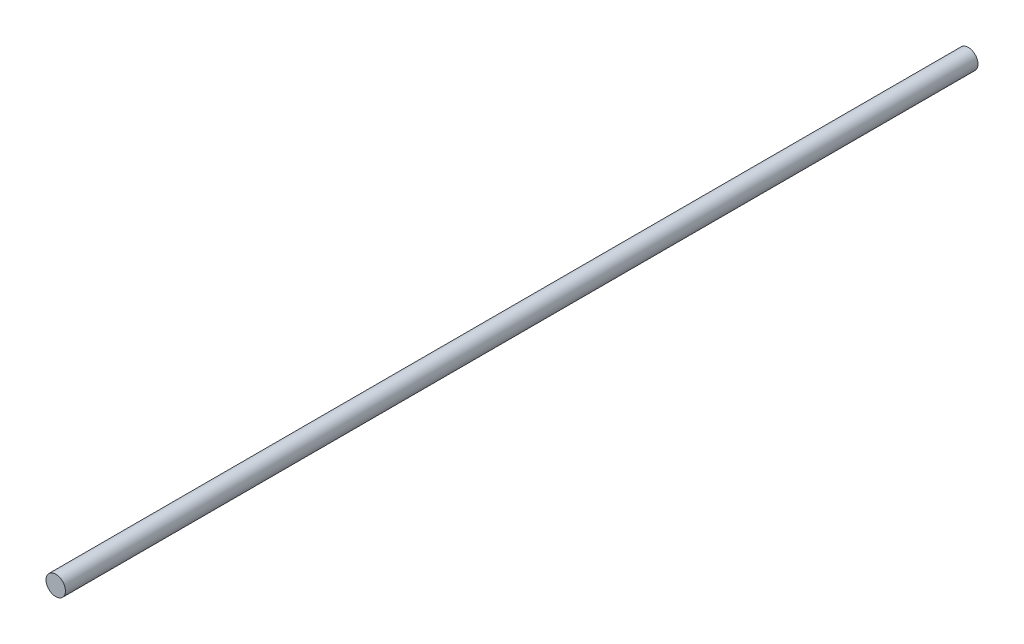
ISO-10303-21;
HEADER;
FILE_DESCRIPTION(('STEP AP214'),'2;1');
FILE_NAME('part.step','',(''),(''),'','','');
FILE_SCHEMA(('AUTOMOTIVE_DESIGN { 1 0 10303 214 1 1 1 1 }'));
ENDSEC;
DATA;
#1=APPLICATION_CONTEXT('core data for automotive mechanical design processes');
#2=APPLICATION_PROTOCOL_DEFINITION('international standard','automotive_design',2000,#1);
#3=PRODUCT_CONTEXT('',#1,'mechanical');
#4=PRODUCT('Part','Part','',(#3));
#5=PRODUCT_RELATED_PRODUCT_CATEGORY('part','',(#4));
#6=PRODUCT_DEFINITION_FORMATION('','',#4);
#7=PRODUCT_DEFINITION_CONTEXT('part definition',#1,'design');
#8=PRODUCT_DEFINITION('design','',#6,#7);
#9=PRODUCT_DEFINITION_SHAPE('','',#8);
#10=(LENGTH_UNIT() NAMED_UNIT(*) SI_UNIT(.MILLI.,.METRE.));
#11=(NAMED_UNIT(*) PLANE_ANGLE_UNIT() SI_UNIT($,.RADIAN.));
#12=(NAMED_UNIT(*) SI_UNIT($,.STERADIAN.) SOLID_ANGLE_UNIT());
#13=UNCERTAINTY_MEASURE_WITH_UNIT(LENGTH_MEASURE(1.E-05),#10,'distance_accuracy_value','');
#14=(GEOMETRIC_REPRESENTATION_CONTEXT(3) GLOBAL_UNCERTAINTY_ASSIGNED_CONTEXT((#13)) GLOBAL_UNIT_ASSIGNED_CONTEXT((#10,
#11,#12)) REPRESENTATION_CONTEXT('',''));
#15=CARTESIAN_POINT('',(0.,0.,0.));
#16=DIRECTION('',(0.,0.,1.));
#17=DIRECTION('',(1.,0.,0.));
#18=AXIS2_PLACEMENT_3D('',#15,#16,#17);
#19=CARTESIAN_POINT('',(-48.8752986194464,81.4071564152755,375.));
#20=DIRECTION('',(0.,0.,-1.));
#21=DIRECTION('',(-1.,0.,0.));
#22=AXIS2_PLACEMENT_3D('',#19,#20,#21);
#23=CYLINDRICAL_SURFACE('',#22,4.);
#24=CARTESIAN_POINT('',(-48.8752986194464,81.4071564152755,375.));
#25=DIRECTION('',(0.,0.,1.));
#26=DIRECTION('',(1.,0.,0.));
#27=AXIS2_PLACEMENT_3D('',#24,#25,#26);
#28=CIRCLE('',#27,4.);
#29=CARTESIAN_POINT('',(-44.8752986194464,81.4071564152755,375.));
#30=VERTEX_POINT('',#29);
#31=EDGE_CURVE('E10',#30,#30,#28,.T.);
#32=ORIENTED_EDGE('',*,*,#31,.F.);
#33=EDGE_LOOP('',(#32));
#34=FACE_BOUND('',#33,.T.);
#35=CARTESIAN_POINT('',(-48.8752986194464,81.4071564152755,0.));
#36=DIRECTION('',(0.,0.,1.));
#37=DIRECTION('',(1.,0.,0.));
#38=AXIS2_PLACEMENT_3D('',#35,#36,#37);
#39=CIRCLE('',#38,4.);
#40=CARTESIAN_POINT('',(-44.8752986194464,81.4071564152755,0.));
#41=VERTEX_POINT('',#40);
#42=EDGE_CURVE('E37',#41,#41,#39,.T.);
#43=ORIENTED_EDGE('',*,*,#42,.T.);
#44=EDGE_LOOP('',(#43));
#45=FACE_BOUND('',#44,.T.);
#46=ADVANCED_FACE('F34',(#34,#45),#23,.T.);
#47=CARTESIAN_POINT('',(-48.8752986194464,81.4071564152755,375.));
#48=DIRECTION('',(0.,0.,1.));
#49=DIRECTION('',(1.,0.,0.));
#50=AXIS2_PLACEMENT_3D('',#47,#48,#49);
#51=PLANE('',#50);
#52=ORIENTED_EDGE('',*,*,#31,.T.);
#53=EDGE_LOOP('',(#52));
#54=FACE_BOUND('',#53,.T.);
#55=ADVANCED_FACE('F49',(#54),#51,.T.);
#56=CARTESIAN_POINT('',(-48.8752986194464,81.4071564152755,0.));
#57=DIRECTION('',(0.,0.,1.));
#58=DIRECTION('',(1.,0.,0.));
#59=AXIS2_PLACEMENT_3D('',#56,#57,#58);
#60=PLANE('',#59);
#61=ORIENTED_EDGE('',*,*,#42,.F.);
#62=EDGE_LOOP('',(#61));
#63=FACE_BOUND('',#62,.T.);
#64=ADVANCED_FACE('F47',(#63),#60,.F.);
#65=CLOSED_SHELL('',(#46,#55,#64));
#66=MANIFOLD_SOLID_BREP('B2',#65);
#67=ADVANCED_BREP_SHAPE_REPRESENTATION('',(#18,#66),#14);
#68=SHAPE_DEFINITION_REPRESENTATION(#9,#67);
ENDSEC;
END-ISO-10303-21;
